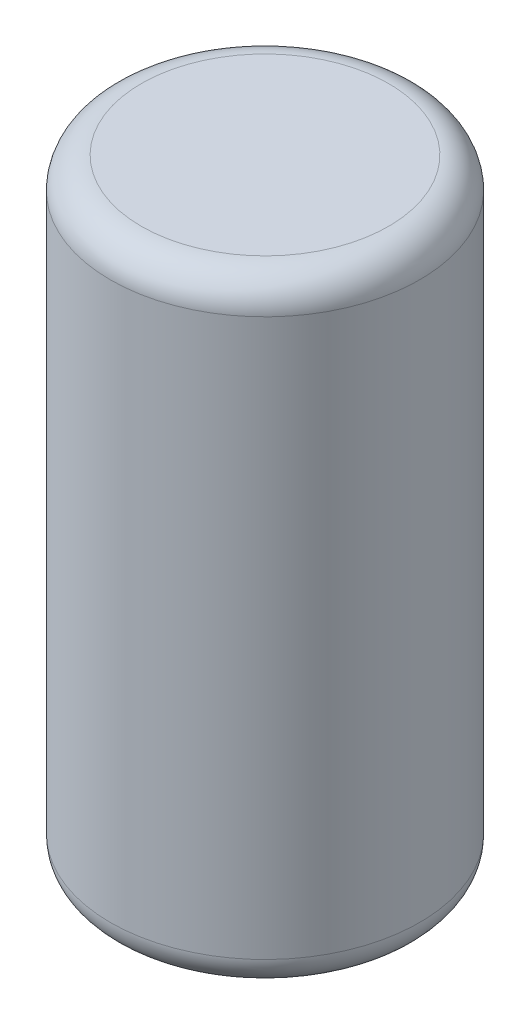
ISO-10303-21;
HEADER;
FILE_DESCRIPTION(('STEP AP214'),'2;1');
FILE_NAME('part.step','',(''),(''),'','','');
FILE_SCHEMA(('AUTOMOTIVE_DESIGN { 1 0 10303 214 1 1 1 1 }'));
ENDSEC;
DATA;
#1=APPLICATION_CONTEXT('core data for automotive mechanical design processes');
#2=APPLICATION_PROTOCOL_DEFINITION('international standard','automotive_design',2000,#1);
#3=PRODUCT_CONTEXT('',#1,'mechanical');
#4=PRODUCT('Part','Part','',(#3));
#5=PRODUCT_RELATED_PRODUCT_CATEGORY('part','',(#4));
#6=PRODUCT_DEFINITION_FORMATION('','',#4);
#7=PRODUCT_DEFINITION_CONTEXT('part definition',#1,'design');
#8=PRODUCT_DEFINITION('design','',#6,#7);
#9=PRODUCT_DEFINITION_SHAPE('','',#8);
#10=(LENGTH_UNIT() NAMED_UNIT(*) SI_UNIT(.MILLI.,.METRE.));
#11=(NAMED_UNIT(*) PLANE_ANGLE_UNIT() SI_UNIT($,.RADIAN.));
#12=(NAMED_UNIT(*) SI_UNIT($,.STERADIAN.) SOLID_ANGLE_UNIT());
#13=UNCERTAINTY_MEASURE_WITH_UNIT(LENGTH_MEASURE(1.E-05),#10,'distance_accuracy_value','');
#14=(GEOMETRIC_REPRESENTATION_CONTEXT(3) GLOBAL_UNCERTAINTY_ASSIGNED_CONTEXT((#13)) GLOBAL_UNIT_ASSIGNED_CONTEXT((#10,
#11,#12)) REPRESENTATION_CONTEXT('',''));
#15=CARTESIAN_POINT('',(0.,0.,0.));
#16=DIRECTION('',(0.,0.,1.));
#17=DIRECTION('',(1.,0.,0.));
#18=AXIS2_PLACEMENT_3D('',#15,#16,#17);
#19=CARTESIAN_POINT('',(0.,12.7,0.));
#20=DIRECTION('',(0.,-1.,0.));
#21=DIRECTION('',(0.,0.,-1.));
#22=AXIS2_PLACEMENT_3D('',#19,#20,#21);
#23=CYLINDRICAL_SURFACE('',#22,3.175);
#24=CARTESIAN_POINT('',(0.,0.635,0.));
#25=DIRECTION('',(0.,1.,0.));
#26=DIRECTION('',(0.,0.,1.));
#27=AXIS2_PLACEMENT_3D('',#24,#25,#26);
#28=CIRCLE('',#27,3.175);
#29=CARTESIAN_POINT('',(0.,0.635,3.175));
#30=VERTEX_POINT('',#29);
#31=EDGE_CURVE('E41',#30,#30,#28,.T.);
#32=ORIENTED_EDGE('',*,*,#31,.T.);
#33=EDGE_LOOP('',(#32));
#34=FACE_BOUND('',#33,.T.);
#35=CARTESIAN_POINT('',(0.,12.065,0.));
#36=DIRECTION('',(0.,1.,0.));
#37=DIRECTION('',(0.,0.,1.));
#38=AXIS2_PLACEMENT_3D('',#35,#36,#37);
#39=CIRCLE('',#38,3.175);
#40=CARTESIAN_POINT('',(0.,12.065,3.175));
#41=VERTEX_POINT('',#40);
#42=EDGE_CURVE('E45',#41,#41,#39,.F.);
#43=ORIENTED_EDGE('',*,*,#42,.T.);
#44=EDGE_LOOP('',(#43));
#45=FACE_BOUND('',#44,.T.);
#46=ADVANCED_FACE('F30',(#34,#45),#23,.T.);
#47=CARTESIAN_POINT('',(0.,12.7,0.));
#48=DIRECTION('',(0.,1.,0.));
#49=DIRECTION('',(0.,0.,1.));
#50=AXIS2_PLACEMENT_3D('',#47,#48,#49);
#51=PLANE('',#50);
#52=CARTESIAN_POINT('',(0.,12.7,0.));
#53=DIRECTION('',(0.,1.,0.));
#54=DIRECTION('',(0.,0.,1.));
#55=AXIS2_PLACEMENT_3D('',#52,#53,#54);
#56=CIRCLE('',#55,2.54);
#57=CARTESIAN_POINT('',(0.,12.7,2.54));
#58=VERTEX_POINT('',#57);
#59=EDGE_CURVE('E10',#58,#58,#56,.T.);
#60=ORIENTED_EDGE('',*,*,#59,.T.);
#61=EDGE_LOOP('',(#60));
#62=FACE_BOUND('',#61,.T.);
#63=ADVANCED_FACE('F61',(#62),#51,.T.);
#64=CARTESIAN_POINT('',(0.,0.,0.));
#65=DIRECTION('',(0.,1.,0.));
#66=DIRECTION('',(0.,0.,1.));
#67=AXIS2_PLACEMENT_3D('',#64,#65,#66);
#68=PLANE('',#67);
#69=CARTESIAN_POINT('',(0.,0.,0.));
#70=DIRECTION('',(0.,1.,0.));
#71=DIRECTION('',(0.,0.,1.));
#72=AXIS2_PLACEMENT_3D('',#69,#70,#71);
#73=CIRCLE('',#72,2.54);
#74=CARTESIAN_POINT('',(0.,0.,2.54));
#75=VERTEX_POINT('',#74);
#76=EDGE_CURVE('E37',#75,#75,#73,.F.);
#77=ORIENTED_EDGE('',*,*,#76,.T.);
#78=EDGE_LOOP('',(#77));
#79=FACE_BOUND('',#78,.T.);
#80=ADVANCED_FACE('F58',(#79),#68,.F.);
#81=CARTESIAN_POINT('',(0.,0.635,0.));
#82=DIRECTION('',(0.,1.,0.));
#83=DIRECTION('',(0.,0.,1.));
#84=AXIS2_PLACEMENT_3D('',#81,#82,#83);
#85=TOROIDAL_SURFACE('',#84,2.54,0.635);
#86=ORIENTED_EDGE('',*,*,#76,.F.);
#87=EDGE_LOOP('',(#86));
#88=FACE_BOUND('',#87,.T.);
#89=ORIENTED_EDGE('',*,*,#31,.F.);
#90=EDGE_LOOP('',(#89));
#91=FACE_BOUND('',#90,.T.);
#92=ADVANCED_FACE('F54',(#88,#91),#85,.T.);
#93=CARTESIAN_POINT('',(0.,12.065,0.));
#94=DIRECTION('',(0.,1.,0.));
#95=DIRECTION('',(0.,0.,1.));
#96=AXIS2_PLACEMENT_3D('',#93,#94,#95);
#97=TOROIDAL_SURFACE('',#96,2.54,0.635);
#98=ORIENTED_EDGE('',*,*,#42,.F.);
#99=EDGE_LOOP('',(#98));
#100=FACE_BOUND('',#99,.T.);
#101=ORIENTED_EDGE('',*,*,#59,.F.);
#102=EDGE_LOOP('',(#101));
#103=FACE_BOUND('',#102,.T.);
#104=ADVANCED_FACE('F32',(#100,#103),#97,.T.);
#105=CLOSED_SHELL('',(#46,#63,#80,#92,#104));
#106=MANIFOLD_SOLID_BREP('B2',#105);
#107=ADVANCED_BREP_SHAPE_REPRESENTATION('',(#18,#106),#14);
#108=SHAPE_DEFINITION_REPRESENTATION(#9,#107);
ENDSEC;
END-ISO-10303-21;
